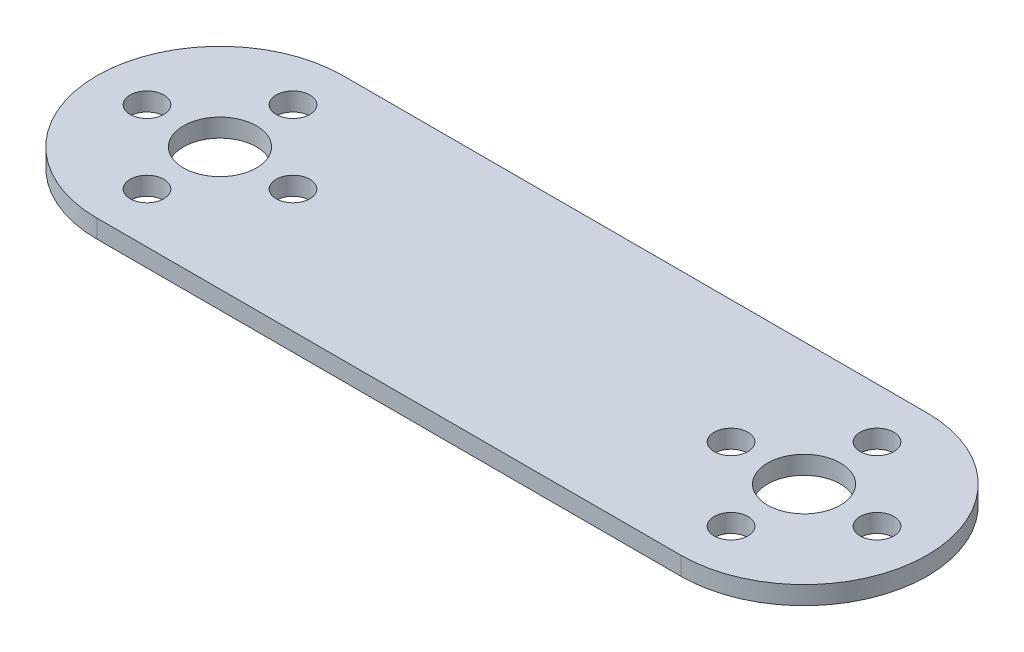
ISO-10303-21;
HEADER;
FILE_DESCRIPTION(('STEP AP214'),'2;1');
FILE_NAME('part.step','',(''),(''),'','','');
FILE_SCHEMA(('AUTOMOTIVE_DESIGN { 1 0 10303 214 1 1 1 1 }'));
ENDSEC;
DATA;
#1=APPLICATION_CONTEXT('core data for automotive mechanical design processes');
#2=APPLICATION_PROTOCOL_DEFINITION('international standard','automotive_design',2000,#1);
#3=PRODUCT_CONTEXT('',#1,'mechanical');
#4=PRODUCT('Part','Part','',(#3));
#5=PRODUCT_RELATED_PRODUCT_CATEGORY('part','',(#4));
#6=PRODUCT_DEFINITION_FORMATION('','',#4);
#7=PRODUCT_DEFINITION_CONTEXT('part definition',#1,'design');
#8=PRODUCT_DEFINITION('design','',#6,#7);
#9=PRODUCT_DEFINITION_SHAPE('','',#8);
#10=(LENGTH_UNIT() NAMED_UNIT(*) SI_UNIT(.MILLI.,.METRE.));
#11=(NAMED_UNIT(*) PLANE_ANGLE_UNIT() SI_UNIT($,.RADIAN.));
#12=(NAMED_UNIT(*) SI_UNIT($,.STERADIAN.) SOLID_ANGLE_UNIT());
#13=UNCERTAINTY_MEASURE_WITH_UNIT(LENGTH_MEASURE(1.E-05),#10,'distance_accuracy_value','');
#14=(GEOMETRIC_REPRESENTATION_CONTEXT(3) GLOBAL_UNCERTAINTY_ASSIGNED_CONTEXT((#13)) GLOBAL_UNIT_ASSIGNED_CONTEXT((#10,
#11,#12)) REPRESENTATION_CONTEXT('',''));
#15=CARTESIAN_POINT('',(0.,0.,0.));
#16=DIRECTION('',(0.,0.,1.));
#17=DIRECTION('',(1.,0.,0.));
#18=AXIS2_PLACEMENT_3D('',#15,#16,#17);
#19=CARTESIAN_POINT('',(0.,2.,0.));
#20=DIRECTION('',(0.,1.,0.));
#21=DIRECTION('',(0.,0.,1.));
#22=AXIS2_PLACEMENT_3D('',#19,#20,#21);
#23=PLANE('',#22);
#24=CARTESIAN_POINT('',(56.,2.,0.));
#25=DIRECTION('',(0.,1.,0.));
#26=DIRECTION('',(0.,0.,1.));
#27=AXIS2_PLACEMENT_3D('',#24,#25,#26);
#28=CIRCLE('',#27,1.85);
#29=CARTESIAN_POINT('',(56.,2.,1.85));
#30=VERTEX_POINT('',#29);
#31=EDGE_CURVE('E114',#30,#30,#28,.F.);
#32=ORIENTED_EDGE('',*,*,#31,.T.);
#33=EDGE_LOOP('',(#32));
#34=FACE_BOUND('',#33,.T.);
#35=CARTESIAN_POINT('',(64.,2.,8.));
#36=DIRECTION('',(0.,1.,0.));
#37=DIRECTION('',(0.,0.,1.));
#38=AXIS2_PLACEMENT_3D('',#35,#36,#37);
#39=CIRCLE('',#38,1.85);
#40=CARTESIAN_POINT('',(64.,2.,9.85));
#41=VERTEX_POINT('',#40);
#42=EDGE_CURVE('E117',#41,#41,#39,.F.);
#43=ORIENTED_EDGE('',*,*,#42,.T.);
#44=EDGE_LOOP('',(#43));
#45=FACE_BOUND('',#44,.T.);
#46=CARTESIAN_POINT('',(72.,2.,0.));
#47=DIRECTION('',(0.,1.,0.));
#48=DIRECTION('',(0.,0.,1.));
#49=AXIS2_PLACEMENT_3D('',#46,#47,#48);
#50=CIRCLE('',#49,1.85);
#51=CARTESIAN_POINT('',(72.,2.,1.85));
#52=VERTEX_POINT('',#51);
#53=EDGE_CURVE('E120',#52,#52,#50,.F.);
#54=ORIENTED_EDGE('',*,*,#53,.T.);
#55=EDGE_LOOP('',(#54));
#56=FACE_BOUND('',#55,.T.);
#57=CARTESIAN_POINT('',(64.,2.,-8.));
#58=DIRECTION('',(0.,1.,0.));
#59=DIRECTION('',(0.,0.,1.));
#60=AXIS2_PLACEMENT_3D('',#57,#58,#59);
#61=CIRCLE('',#60,1.85);
#62=CARTESIAN_POINT('',(64.,2.,-6.15));
#63=VERTEX_POINT('',#62);
#64=EDGE_CURVE('E123',#63,#63,#61,.F.);
#65=ORIENTED_EDGE('',*,*,#64,.T.);
#66=EDGE_LOOP('',(#65));
#67=FACE_BOUND('',#66,.T.);
#68=CARTESIAN_POINT('',(64.,2.,0.));
#69=DIRECTION('',(0.,1.,0.));
#70=DIRECTION('',(0.,0.,1.));
#71=AXIS2_PLACEMENT_3D('',#68,#69,#70);
#72=CIRCLE('',#71,4.);
#73=CARTESIAN_POINT('',(64.,2.,4.));
#74=VERTEX_POINT('',#73);
#75=EDGE_CURVE('E126',#74,#74,#72,.F.);
#76=ORIENTED_EDGE('',*,*,#75,.T.);
#77=EDGE_LOOP('',(#76));
#78=FACE_BOUND('',#77,.T.);
#79=CARTESIAN_POINT('',(-8.,2.,0.));
#80=DIRECTION('',(0.,1.,0.));
#81=DIRECTION('',(0.,0.,1.));
#82=AXIS2_PLACEMENT_3D('',#79,#80,#81);
#83=CIRCLE('',#82,1.85);
#84=CARTESIAN_POINT('',(-8.,2.,1.85));
#85=VERTEX_POINT('',#84);
#86=EDGE_CURVE('E129',#85,#85,#83,.F.);
#87=ORIENTED_EDGE('',*,*,#86,.T.);
#88=EDGE_LOOP('',(#87));
#89=FACE_BOUND('',#88,.T.);
#90=CARTESIAN_POINT('',(0.,2.,8.));
#91=DIRECTION('',(0.,1.,0.));
#92=DIRECTION('',(0.,0.,1.));
#93=AXIS2_PLACEMENT_3D('',#90,#91,#92);
#94=CIRCLE('',#93,1.85);
#95=CARTESIAN_POINT('',(0.,2.,9.85));
#96=VERTEX_POINT('',#95);
#97=EDGE_CURVE('E132',#96,#96,#94,.F.);
#98=ORIENTED_EDGE('',*,*,#97,.T.);
#99=EDGE_LOOP('',(#98));
#100=FACE_BOUND('',#99,.T.);
#101=CARTESIAN_POINT('',(8.,2.,0.));
#102=DIRECTION('',(0.,1.,0.));
#103=DIRECTION('',(0.,0.,1.));
#104=AXIS2_PLACEMENT_3D('',#101,#102,#103);
#105=CIRCLE('',#104,1.85);
#106=CARTESIAN_POINT('',(8.,2.,1.85));
#107=VERTEX_POINT('',#106);
#108=EDGE_CURVE('E135',#107,#107,#105,.F.);
#109=ORIENTED_EDGE('',*,*,#108,.T.);
#110=EDGE_LOOP('',(#109));
#111=FACE_BOUND('',#110,.T.);
#112=CARTESIAN_POINT('',(0.,2.,-8.));
#113=DIRECTION('',(0.,1.,0.));
#114=DIRECTION('',(0.,0.,1.));
#115=AXIS2_PLACEMENT_3D('',#112,#113,#114);
#116=CIRCLE('',#115,1.85);
#117=CARTESIAN_POINT('',(0.,2.,-6.15));
#118=VERTEX_POINT('',#117);
#119=EDGE_CURVE('E138',#118,#118,#116,.F.);
#120=ORIENTED_EDGE('',*,*,#119,.T.);
#121=EDGE_LOOP('',(#120));
#122=FACE_BOUND('',#121,.T.);
#123=CARTESIAN_POINT('',(0.,2.,0.));
#124=DIRECTION('',(0.,1.,0.));
#125=DIRECTION('',(0.,0.,1.));
#126=AXIS2_PLACEMENT_3D('',#123,#124,#125);
#127=CIRCLE('',#126,4.);
#128=CARTESIAN_POINT('',(0.,2.,4.));
#129=VERTEX_POINT('',#128);
#130=EDGE_CURVE('E141',#129,#129,#127,.F.);
#131=ORIENTED_EDGE('',*,*,#130,.T.);
#132=EDGE_LOOP('',(#131));
#133=FACE_BOUND('',#132,.T.);
#134=CARTESIAN_POINT('',(64.,2.,0.));
#135=DIRECTION('',(0.,1.,0.));
#136=DIRECTION('',(0.,0.,1.));
#137=AXIS2_PLACEMENT_3D('',#134,#135,#136);
#138=CIRCLE('',#137,13.5);
#139=CARTESIAN_POINT('',(64.,2.,-13.5));
#140=VERTEX_POINT('',#139);
#141=CARTESIAN_POINT('',(64.,2.,13.5));
#142=VERTEX_POINT('',#141);
#143=EDGE_CURVE('E21',#140,#142,#138,.F.);
#144=ORIENTED_EDGE('',*,*,#143,.F.);
#145=DIRECTION('',(-1.,0.,0.));
#146=VECTOR('',#145,1.);
#147=CARTESIAN_POINT('',(64.,2.,-13.5));
#148=LINE('',#147,#146);
#149=CARTESIAN_POINT('',(0.,2.,-13.5));
#150=VERTEX_POINT('',#149);
#151=EDGE_CURVE('E55',#150,#140,#148,.F.);
#152=ORIENTED_EDGE('',*,*,#151,.F.);
#153=CARTESIAN_POINT('',(0.,2.,0.));
#154=DIRECTION('',(0.,1.,0.));
#155=DIRECTION('',(0.,0.,1.));
#156=AXIS2_PLACEMENT_3D('',#153,#154,#155);
#157=CIRCLE('',#156,13.5);
#158=CARTESIAN_POINT('',(0.,2.,13.5));
#159=VERTEX_POINT('',#158);
#160=EDGE_CURVE('E70',#159,#150,#157,.F.);
#161=ORIENTED_EDGE('',*,*,#160,.F.);
#162=DIRECTION('',(1.,0.,0.));
#163=VECTOR('',#162,1.);
#164=CARTESIAN_POINT('',(0.,2.,13.5));
#165=LINE('',#164,#163);
#166=EDGE_CURVE('E68',#142,#159,#165,.F.);
#167=ORIENTED_EDGE('',*,*,#166,.F.);
#168=EDGE_LOOP('',(#144,#152,#161,#167));
#169=FACE_BOUND('',#168,.T.);
#170=ADVANCED_FACE('F18',(#34,#45,#56,#67,#78,#89,#100,#111,#122,#133,#169),#23,.T.);
#171=CARTESIAN_POINT('',(0.,0.,13.5));
#172=DIRECTION('',(0.,0.,1.));
#173=DIRECTION('',(1.,0.,0.));
#174=AXIS2_PLACEMENT_3D('',#171,#172,#173);
#175=PLANE('',#174);
#176=ORIENTED_EDGE('',*,*,#166,.T.);
#177=DIRECTION('',(0.,1.,0.));
#178=VECTOR('',#177,1.);
#179=CARTESIAN_POINT('',(0.,0.,13.5));
#180=LINE('',#179,#178);
#181=CARTESIAN_POINT('',(0.,0.,13.5));
#182=VERTEX_POINT('',#181);
#183=EDGE_CURVE('E143',#182,#159,#180,.T.);
#184=ORIENTED_EDGE('',*,*,#183,.F.);
#185=DIRECTION('',(1.,0.,0.));
#186=VECTOR('',#185,1.);
#187=CARTESIAN_POINT('',(0.,0.,13.5));
#188=LINE('',#187,#186);
#189=CARTESIAN_POINT('',(64.,0.,13.5));
#190=VERTEX_POINT('',#189);
#191=EDGE_CURVE('E77',#182,#190,#188,.T.);
#192=ORIENTED_EDGE('',*,*,#191,.T.);
#193=DIRECTION('',(0.,1.,0.));
#194=VECTOR('',#193,1.);
#195=CARTESIAN_POINT('',(64.,0.,13.5));
#196=LINE('',#195,#194);
#197=EDGE_CURVE('E64',#142,#190,#196,.F.);
#198=ORIENTED_EDGE('',*,*,#197,.F.);
#199=EDGE_LOOP('',(#176,#184,#192,#198));
#200=FACE_BOUND('',#199,.T.);
#201=ADVANCED_FACE('F76',(#200),#175,.T.);
#202=CARTESIAN_POINT('',(64.,0.,0.));
#203=DIRECTION('',(0.,1.,0.));
#204=DIRECTION('',(0.,0.,1.));
#205=AXIS2_PLACEMENT_3D('',#202,#203,#204);
#206=CYLINDRICAL_SURFACE('',#205,13.5);
#207=ORIENTED_EDGE('',*,*,#143,.T.);
#208=ORIENTED_EDGE('',*,*,#197,.T.);
#209=CARTESIAN_POINT('',(64.,0.,0.));
#210=DIRECTION('',(0.,1.,0.));
#211=DIRECTION('',(0.,0.,1.));
#212=AXIS2_PLACEMENT_3D('',#209,#210,#211);
#213=CIRCLE('',#212,13.5);
#214=CARTESIAN_POINT('',(64.,0.,-13.5));
#215=VERTEX_POINT('',#214);
#216=EDGE_CURVE('E112',#190,#215,#213,.T.);
#217=ORIENTED_EDGE('',*,*,#216,.T.);
#218=DIRECTION('',(0.,1.,0.));
#219=VECTOR('',#218,1.);
#220=CARTESIAN_POINT('',(64.,0.,-13.5));
#221=LINE('',#220,#219);
#222=EDGE_CURVE('E66',#140,#215,#221,.F.);
#223=ORIENTED_EDGE('',*,*,#222,.F.);
#224=EDGE_LOOP('',(#207,#208,#217,#223));
#225=FACE_BOUND('',#224,.T.);
#226=ADVANCED_FACE('F61',(#225),#206,.T.);
#227=CARTESIAN_POINT('',(64.,0.,-13.5));
#228=DIRECTION('',(0.,0.,-1.));
#229=DIRECTION('',(-1.,0.,0.));
#230=AXIS2_PLACEMENT_3D('',#227,#228,#229);
#231=PLANE('',#230);
#232=ORIENTED_EDGE('',*,*,#151,.T.);
#233=ORIENTED_EDGE('',*,*,#222,.T.);
#234=DIRECTION('',(1.,0.,0.));
#235=VECTOR('',#234,1.);
#236=CARTESIAN_POINT('',(0.,0.,-13.5));
#237=LINE('',#236,#235);
#238=CARTESIAN_POINT('',(0.,0.,-13.5));
#239=VERTEX_POINT('',#238);
#240=EDGE_CURVE('E111',#215,#239,#237,.F.);
#241=ORIENTED_EDGE('',*,*,#240,.T.);
#242=DIRECTION('',(0.,1.,0.));
#243=VECTOR('',#242,1.);
#244=CARTESIAN_POINT('',(0.,0.,-13.5));
#245=LINE('',#244,#243);
#246=EDGE_CURVE('E36',#150,#239,#245,.F.);
#247=ORIENTED_EDGE('',*,*,#246,.F.);
#248=EDGE_LOOP('',(#232,#233,#241,#247));
#249=FACE_BOUND('',#248,.T.);
#250=ADVANCED_FACE('F149',(#249),#231,.T.);
#251=CARTESIAN_POINT('',(0.,0.,0.));
#252=DIRECTION('',(0.,1.,0.));
#253=DIRECTION('',(0.,0.,1.));
#254=AXIS2_PLACEMENT_3D('',#251,#252,#253);
#255=CYLINDRICAL_SURFACE('',#254,13.5);
#256=ORIENTED_EDGE('',*,*,#160,.T.);
#257=ORIENTED_EDGE('',*,*,#246,.T.);
#258=CARTESIAN_POINT('',(0.,0.,0.));
#259=DIRECTION('',(0.,1.,0.));
#260=DIRECTION('',(0.,0.,1.));
#261=AXIS2_PLACEMENT_3D('',#258,#259,#260);
#262=CIRCLE('',#261,13.5);
#263=EDGE_CURVE('E109',#239,#182,#262,.T.);
#264=ORIENTED_EDGE('',*,*,#263,.T.);
#265=ORIENTED_EDGE('',*,*,#183,.T.);
#266=EDGE_LOOP('',(#256,#257,#264,#265));
#267=FACE_BOUND('',#266,.T.);
#268=ADVANCED_FACE('F152',(#267),#255,.T.);
#269=CARTESIAN_POINT('',(0.,0.,0.));
#270=DIRECTION('',(0.,1.,0.));
#271=DIRECTION('',(0.,0.,1.));
#272=AXIS2_PLACEMENT_3D('',#269,#270,#271);
#273=CYLINDRICAL_SURFACE('',#272,4.);
#274=CARTESIAN_POINT('',(0.,0.,0.));
#275=DIRECTION('',(0.,1.,0.));
#276=DIRECTION('',(0.,0.,1.));
#277=AXIS2_PLACEMENT_3D('',#274,#275,#276);
#278=CIRCLE('',#277,4.);
#279=CARTESIAN_POINT('',(0.,0.,4.));
#280=VERTEX_POINT('',#279);
#281=EDGE_CURVE('E106',#280,#280,#278,.F.);
#282=ORIENTED_EDGE('',*,*,#281,.T.);
#283=EDGE_LOOP('',(#282));
#284=FACE_BOUND('',#283,.T.);
#285=ORIENTED_EDGE('',*,*,#130,.F.);
#286=EDGE_LOOP('',(#285));
#287=FACE_BOUND('',#286,.T.);
#288=ADVANCED_FACE('F154',(#284,#287),#273,.F.);
#289=CARTESIAN_POINT('',(0.,0.,-8.));
#290=DIRECTION('',(0.,1.,0.));
#291=DIRECTION('',(0.,0.,1.));
#292=AXIS2_PLACEMENT_3D('',#289,#290,#291);
#293=CYLINDRICAL_SURFACE('',#292,1.85);
#294=CARTESIAN_POINT('',(0.,0.,-8.));
#295=DIRECTION('',(0.,1.,0.));
#296=DIRECTION('',(0.,0.,1.));
#297=AXIS2_PLACEMENT_3D('',#294,#295,#296);
#298=CIRCLE('',#297,1.85);
#299=CARTESIAN_POINT('',(0.,0.,-6.15));
#300=VERTEX_POINT('',#299);
#301=EDGE_CURVE('E103',#300,#300,#298,.F.);
#302=ORIENTED_EDGE('',*,*,#301,.T.);
#303=EDGE_LOOP('',(#302));
#304=FACE_BOUND('',#303,.T.);
#305=ORIENTED_EDGE('',*,*,#119,.F.);
#306=EDGE_LOOP('',(#305));
#307=FACE_BOUND('',#306,.T.);
#308=ADVANCED_FACE('F161',(#304,#307),#293,.F.);
#309=CARTESIAN_POINT('',(8.,0.,0.));
#310=DIRECTION('',(0.,1.,0.));
#311=DIRECTION('',(0.,0.,1.));
#312=AXIS2_PLACEMENT_3D('',#309,#310,#311);
#313=CYLINDRICAL_SURFACE('',#312,1.85);
#314=CARTESIAN_POINT('',(8.,0.,0.));
#315=DIRECTION('',(0.,1.,0.));
#316=DIRECTION('',(0.,0.,1.));
#317=AXIS2_PLACEMENT_3D('',#314,#315,#316);
#318=CIRCLE('',#317,1.85);
#319=CARTESIAN_POINT('',(8.,0.,1.85));
#320=VERTEX_POINT('',#319);
#321=EDGE_CURVE('E100',#320,#320,#318,.F.);
#322=ORIENTED_EDGE('',*,*,#321,.T.);
#323=EDGE_LOOP('',(#322));
#324=FACE_BOUND('',#323,.T.);
#325=ORIENTED_EDGE('',*,*,#108,.F.);
#326=EDGE_LOOP('',(#325));
#327=FACE_BOUND('',#326,.T.);
#328=ADVANCED_FACE('F200',(#324,#327),#313,.F.);
#329=CARTESIAN_POINT('',(0.,0.,8.));
#330=DIRECTION('',(0.,1.,0.));
#331=DIRECTION('',(0.,0.,1.));
#332=AXIS2_PLACEMENT_3D('',#329,#330,#331);
#333=CYLINDRICAL_SURFACE('',#332,1.85);
#334=CARTESIAN_POINT('',(0.,0.,8.));
#335=DIRECTION('',(0.,1.,0.));
#336=DIRECTION('',(0.,0.,1.));
#337=AXIS2_PLACEMENT_3D('',#334,#335,#336);
#338=CIRCLE('',#337,1.85);
#339=CARTESIAN_POINT('',(0.,0.,9.85));
#340=VERTEX_POINT('',#339);
#341=EDGE_CURVE('E97',#340,#340,#338,.F.);
#342=ORIENTED_EDGE('',*,*,#341,.T.);
#343=EDGE_LOOP('',(#342));
#344=FACE_BOUND('',#343,.T.);
#345=ORIENTED_EDGE('',*,*,#97,.F.);
#346=EDGE_LOOP('',(#345));
#347=FACE_BOUND('',#346,.T.);
#348=ADVANCED_FACE('F196',(#344,#347),#333,.F.);
#349=CARTESIAN_POINT('',(-8.,0.,0.));
#350=DIRECTION('',(0.,1.,0.));
#351=DIRECTION('',(0.,0.,1.));
#352=AXIS2_PLACEMENT_3D('',#349,#350,#351);
#353=CYLINDRICAL_SURFACE('',#352,1.85);
#354=CARTESIAN_POINT('',(-8.,0.,0.));
#355=DIRECTION('',(0.,1.,0.));
#356=DIRECTION('',(0.,0.,1.));
#357=AXIS2_PLACEMENT_3D('',#354,#355,#356);
#358=CIRCLE('',#357,1.85);
#359=CARTESIAN_POINT('',(-8.,0.,1.85));
#360=VERTEX_POINT('',#359);
#361=EDGE_CURVE('E94',#360,#360,#358,.F.);
#362=ORIENTED_EDGE('',*,*,#361,.T.);
#363=EDGE_LOOP('',(#362));
#364=FACE_BOUND('',#363,.T.);
#365=ORIENTED_EDGE('',*,*,#86,.F.);
#366=EDGE_LOOP('',(#365));
#367=FACE_BOUND('',#366,.T.);
#368=ADVANCED_FACE('F192',(#364,#367),#353,.F.);
#369=CARTESIAN_POINT('',(64.,0.,0.));
#370=DIRECTION('',(0.,1.,0.));
#371=DIRECTION('',(0.,0.,1.));
#372=AXIS2_PLACEMENT_3D('',#369,#370,#371);
#373=CYLINDRICAL_SURFACE('',#372,4.);
#374=ORIENTED_EDGE('',*,*,#75,.F.);
#375=EDGE_LOOP('',(#374));
#376=FACE_BOUND('',#375,.T.);
#377=CARTESIAN_POINT('',(64.,0.,0.));
#378=DIRECTION('',(0.,1.,0.));
#379=DIRECTION('',(0.,0.,1.));
#380=AXIS2_PLACEMENT_3D('',#377,#378,#379);
#381=CIRCLE('',#380,4.);
#382=CARTESIAN_POINT('',(64.,0.,4.));
#383=VERTEX_POINT('',#382);
#384=EDGE_CURVE('E91',#383,#383,#381,.F.);
#385=ORIENTED_EDGE('',*,*,#384,.T.);
#386=EDGE_LOOP('',(#385));
#387=FACE_BOUND('',#386,.T.);
#388=ADVANCED_FACE('F188',(#376,#387),#373,.F.);
#389=CARTESIAN_POINT('',(64.,0.,-8.));
#390=DIRECTION('',(0.,1.,0.));
#391=DIRECTION('',(0.,0.,1.));
#392=AXIS2_PLACEMENT_3D('',#389,#390,#391);
#393=CYLINDRICAL_SURFACE('',#392,1.85);
#394=ORIENTED_EDGE('',*,*,#64,.F.);
#395=EDGE_LOOP('',(#394));
#396=FACE_BOUND('',#395,.T.);
#397=CARTESIAN_POINT('',(64.,0.,-8.));
#398=DIRECTION('',(0.,1.,0.));
#399=DIRECTION('',(0.,0.,1.));
#400=AXIS2_PLACEMENT_3D('',#397,#398,#399);
#401=CIRCLE('',#400,1.85);
#402=CARTESIAN_POINT('',(64.,0.,-6.15));
#403=VERTEX_POINT('',#402);
#404=EDGE_CURVE('E88',#403,#403,#401,.F.);
#405=ORIENTED_EDGE('',*,*,#404,.T.);
#406=EDGE_LOOP('',(#405));
#407=FACE_BOUND('',#406,.T.);
#408=ADVANCED_FACE('F184',(#396,#407),#393,.F.);
#409=CARTESIAN_POINT('',(72.,0.,0.));
#410=DIRECTION('',(0.,1.,0.));
#411=DIRECTION('',(0.,0.,1.));
#412=AXIS2_PLACEMENT_3D('',#409,#410,#411);
#413=CYLINDRICAL_SURFACE('',#412,1.85);
#414=ORIENTED_EDGE('',*,*,#53,.F.);
#415=EDGE_LOOP('',(#414));
#416=FACE_BOUND('',#415,.T.);
#417=CARTESIAN_POINT('',(72.,0.,0.));
#418=DIRECTION('',(0.,1.,0.));
#419=DIRECTION('',(0.,0.,1.));
#420=AXIS2_PLACEMENT_3D('',#417,#418,#419);
#421=CIRCLE('',#420,1.85);
#422=CARTESIAN_POINT('',(72.,0.,1.85));
#423=VERTEX_POINT('',#422);
#424=EDGE_CURVE('E85',#423,#423,#421,.F.);
#425=ORIENTED_EDGE('',*,*,#424,.T.);
#426=EDGE_LOOP('',(#425));
#427=FACE_BOUND('',#426,.T.);
#428=ADVANCED_FACE('F180',(#416,#427),#413,.F.);
#429=CARTESIAN_POINT('',(64.,0.,8.));
#430=DIRECTION('',(0.,1.,0.));
#431=DIRECTION('',(0.,0.,1.));
#432=AXIS2_PLACEMENT_3D('',#429,#430,#431);
#433=CYLINDRICAL_SURFACE('',#432,1.85);
#434=ORIENTED_EDGE('',*,*,#42,.F.);
#435=EDGE_LOOP('',(#434));
#436=FACE_BOUND('',#435,.T.);
#437=CARTESIAN_POINT('',(64.,0.,8.));
#438=DIRECTION('',(0.,1.,0.));
#439=DIRECTION('',(0.,0.,1.));
#440=AXIS2_PLACEMENT_3D('',#437,#438,#439);
#441=CIRCLE('',#440,1.85);
#442=CARTESIAN_POINT('',(64.,0.,9.85));
#443=VERTEX_POINT('',#442);
#444=EDGE_CURVE('E27',#443,#443,#441,.F.);
#445=ORIENTED_EDGE('',*,*,#444,.T.);
#446=EDGE_LOOP('',(#445));
#447=FACE_BOUND('',#446,.T.);
#448=ADVANCED_FACE('F172',(#436,#447),#433,.F.);
#449=CARTESIAN_POINT('',(56.,0.,0.));
#450=DIRECTION('',(0.,1.,0.));
#451=DIRECTION('',(0.,0.,1.));
#452=AXIS2_PLACEMENT_3D('',#449,#450,#451);
#453=CYLINDRICAL_SURFACE('',#452,1.85);
#454=ORIENTED_EDGE('',*,*,#31,.F.);
#455=EDGE_LOOP('',(#454));
#456=FACE_BOUND('',#455,.T.);
#457=CARTESIAN_POINT('',(56.,0.,0.));
#458=DIRECTION('',(0.,1.,0.));
#459=DIRECTION('',(0.,0.,1.));
#460=AXIS2_PLACEMENT_3D('',#457,#458,#459);
#461=CIRCLE('',#460,1.85);
#462=CARTESIAN_POINT('',(56.,0.,1.85));
#463=VERTEX_POINT('',#462);
#464=EDGE_CURVE('E11',#463,#463,#461,.F.);
#465=ORIENTED_EDGE('',*,*,#464,.T.);
#466=EDGE_LOOP('',(#465));
#467=FACE_BOUND('',#466,.T.);
#468=ADVANCED_FACE('F166',(#456,#467),#453,.F.);
#469=CARTESIAN_POINT('',(0.,0.,0.));
#470=DIRECTION('',(0.,1.,0.));
#471=DIRECTION('',(0.,0.,1.));
#472=AXIS2_PLACEMENT_3D('',#469,#470,#471);
#473=PLANE('',#472);
#474=ORIENTED_EDGE('',*,*,#464,.F.);
#475=EDGE_LOOP('',(#474));
#476=FACE_BOUND('',#475,.T.);
#477=ORIENTED_EDGE('',*,*,#444,.F.);
#478=EDGE_LOOP('',(#477));
#479=FACE_BOUND('',#478,.T.);
#480=ORIENTED_EDGE('',*,*,#424,.F.);
#481=EDGE_LOOP('',(#480));
#482=FACE_BOUND('',#481,.T.);
#483=ORIENTED_EDGE('',*,*,#404,.F.);
#484=EDGE_LOOP('',(#483));
#485=FACE_BOUND('',#484,.T.);
#486=ORIENTED_EDGE('',*,*,#384,.F.);
#487=EDGE_LOOP('',(#486));
#488=FACE_BOUND('',#487,.T.);
#489=ORIENTED_EDGE('',*,*,#361,.F.);
#490=EDGE_LOOP('',(#489));
#491=FACE_BOUND('',#490,.T.);
#492=ORIENTED_EDGE('',*,*,#341,.F.);
#493=EDGE_LOOP('',(#492));
#494=FACE_BOUND('',#493,.T.);
#495=ORIENTED_EDGE('',*,*,#321,.F.);
#496=EDGE_LOOP('',(#495));
#497=FACE_BOUND('',#496,.T.);
#498=ORIENTED_EDGE('',*,*,#301,.F.);
#499=EDGE_LOOP('',(#498));
#500=FACE_BOUND('',#499,.T.);
#501=ORIENTED_EDGE('',*,*,#281,.F.);
#502=EDGE_LOOP('',(#501));
#503=FACE_BOUND('',#502,.T.);
#504=ORIENTED_EDGE('',*,*,#240,.F.);
#505=ORIENTED_EDGE('',*,*,#216,.F.);
#506=ORIENTED_EDGE('',*,*,#191,.F.);
#507=ORIENTED_EDGE('',*,*,#263,.F.);
#508=EDGE_LOOP('',(#504,#505,#506,#507));
#509=FACE_BOUND('',#508,.T.);
#510=ADVANCED_FACE('F151',(#476,#479,#482,#485,#488,#491,#494,#497,#500,#503,#509),#473,.F.);
#511=CLOSED_SHELL('',(#170,#201,#226,#250,#268,#288,#308,#328,#348,#368,#388,#408,#428,#448,
#468,#510));
#512=MANIFOLD_SOLID_BREP('B1',#511);
#513=ADVANCED_BREP_SHAPE_REPRESENTATION('',(#18,#512),#14);
#514=SHAPE_DEFINITION_REPRESENTATION(#9,#513);
ENDSEC;
END-ISO-10303-21;
